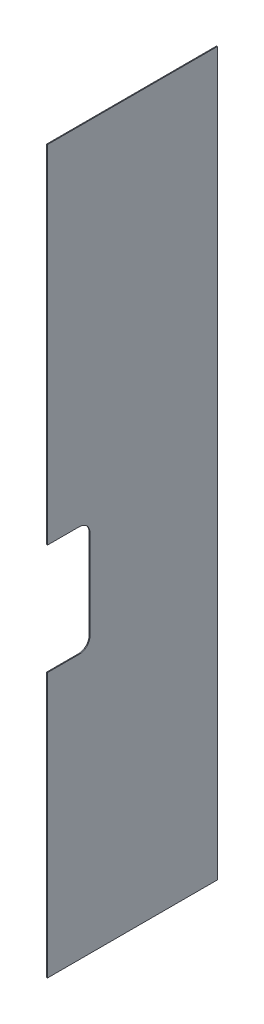
ISO-10303-21;
HEADER;
FILE_DESCRIPTION(('STEP AP214'),'2;1');
FILE_NAME('part.step','',(''),(''),'','','');
FILE_SCHEMA(('AUTOMOTIVE_DESIGN { 1 0 10303 214 1 1 1 1 }'));
ENDSEC;
DATA;
#1=APPLICATION_CONTEXT('core data for automotive mechanical design processes');
#2=APPLICATION_PROTOCOL_DEFINITION('international standard','automotive_design',2000,#1);
#3=PRODUCT_CONTEXT('',#1,'mechanical');
#4=PRODUCT('Part','Part','',(#3));
#5=PRODUCT_RELATED_PRODUCT_CATEGORY('part','',(#4));
#6=PRODUCT_DEFINITION_FORMATION('','',#4);
#7=PRODUCT_DEFINITION_CONTEXT('part definition',#1,'design');
#8=PRODUCT_DEFINITION('design','',#6,#7);
#9=PRODUCT_DEFINITION_SHAPE('','',#8);
#10=(LENGTH_UNIT() NAMED_UNIT(*) SI_UNIT(.MILLI.,.METRE.));
#11=(NAMED_UNIT(*) PLANE_ANGLE_UNIT() SI_UNIT($,.RADIAN.));
#12=(NAMED_UNIT(*) SI_UNIT($,.STERADIAN.) SOLID_ANGLE_UNIT());
#13=UNCERTAINTY_MEASURE_WITH_UNIT(LENGTH_MEASURE(1.E-05),#10,'distance_accuracy_value','');
#14=(GEOMETRIC_REPRESENTATION_CONTEXT(3) GLOBAL_UNCERTAINTY_ASSIGNED_CONTEXT((#13)) GLOBAL_UNIT_ASSIGNED_CONTEXT((#10,
#11,#12)) REPRESENTATION_CONTEXT('',''));
#15=CARTESIAN_POINT('',(0.,0.,0.));
#16=DIRECTION('',(0.,0.,1.));
#17=DIRECTION('',(1.,0.,0.));
#18=AXIS2_PLACEMENT_3D('',#15,#16,#17);
#19=CARTESIAN_POINT('',(0.254,0.,-171.45));
#20=DIRECTION('',(0.,0.,-1.));
#21=DIRECTION('',(0.,1.,0.));
#22=AXIS2_PLACEMENT_3D('',#19,#20,#21);
#23=PLANE('',#22);
#24=DIRECTION('',(0.,-1.,0.));
#25=VECTOR('',#24,1.);
#26=CARTESIAN_POINT('',(0.254,0.,-171.45));
#27=LINE('',#26,#25);
#28=CARTESIAN_POINT('',(0.254,-136.779,-171.45));
#29=VERTEX_POINT('',#28);
#30=CARTESIAN_POINT('',(0.254,-215.9,-171.45));
#31=VERTEX_POINT('',#30);
#32=EDGE_CURVE('E92',#29,#31,#27,.T.);
#33=ORIENTED_EDGE('',*,*,#32,.F.);
#34=DIRECTION('',(-1.,0.,0.));
#35=VECTOR('',#34,1.);
#36=CARTESIAN_POINT('',(0.254,-136.779,-171.45));
#37=LINE('',#36,#35);
#38=CARTESIAN_POINT('',(0.,-136.779,-171.45));
#39=VERTEX_POINT('',#38);
#40=EDGE_CURVE('E116',#29,#39,#37,.T.);
#41=ORIENTED_EDGE('',*,*,#40,.T.);
#42=DIRECTION('',(0.,-1.,0.));
#43=VECTOR('',#42,1.);
#44=CARTESIAN_POINT('',(0.,0.,-171.45));
#45=LINE('',#44,#43);
#46=CARTESIAN_POINT('',(0.,-215.9,-171.45));
#47=VERTEX_POINT('',#46);
#48=EDGE_CURVE('E88',#39,#47,#45,.T.);
#49=ORIENTED_EDGE('',*,*,#48,.T.);
#50=DIRECTION('',(-1.,0.,0.));
#51=VECTOR('',#50,1.);
#52=CARTESIAN_POINT('',(0.254,-215.9,-171.45));
#53=LINE('',#52,#51);
#54=EDGE_CURVE('E11',#31,#47,#53,.T.);
#55=ORIENTED_EDGE('',*,*,#54,.F.);
#56=EDGE_LOOP('',(#33,#41,#49,#55));
#57=FACE_BOUND('',#56,.T.);
#58=ADVANCED_FACE('F35',(#57),#23,.F.);
#59=CARTESIAN_POINT('',(0.,0.,-171.45));
#60=VERTEX_POINT('',#59);
#61=CARTESIAN_POINT('',(0.,-103.759,-171.45));
#62=VERTEX_POINT('',#61);
#63=EDGE_CURVE('E74',#60,#62,#45,.T.);
#64=ORIENTED_EDGE('',*,*,#63,.T.);
#65=DIRECTION('',(-1.,0.,0.));
#66=VECTOR('',#65,1.);
#67=CARTESIAN_POINT('',(0.254,-103.759,-171.45));
#68=LINE('',#67,#66);
#69=CARTESIAN_POINT('',(0.254,-103.759,-171.45));
#70=VERTEX_POINT('',#69);
#71=EDGE_CURVE('E50',#70,#62,#68,.T.);
#72=ORIENTED_EDGE('',*,*,#71,.F.);
#73=CARTESIAN_POINT('',(0.254,0.,-171.45));
#74=VERTEX_POINT('',#73);
#75=EDGE_CURVE('E76',#74,#70,#27,.T.);
#76=ORIENTED_EDGE('',*,*,#75,.F.);
#77=DIRECTION('',(-1.,0.,0.));
#78=VECTOR('',#77,1.);
#79=CARTESIAN_POINT('',(0.254,0.,-171.45));
#80=LINE('',#79,#78);
#81=EDGE_CURVE('E59',#74,#60,#80,.T.);
#82=ORIENTED_EDGE('',*,*,#81,.T.);
#83=EDGE_LOOP('',(#64,#72,#76,#82));
#84=FACE_BOUND('',#83,.T.);
#85=ADVANCED_FACE('F37',(#84),#23,.F.);
#86=CARTESIAN_POINT('',(0.254,0.,-222.25));
#87=DIRECTION('',(0.,0.,-1.));
#88=DIRECTION('',(0.,1.,0.));
#89=AXIS2_PLACEMENT_3D('',#86,#87,#88);
#90=PLANE('',#89);
#91=DIRECTION('',(-1.,0.,0.));
#92=VECTOR('',#91,1.);
#93=CARTESIAN_POINT('',(0.254,-215.9,-222.25));
#94=LINE('',#93,#92);
#95=CARTESIAN_POINT('',(0.254,-215.9,-222.25));
#96=VERTEX_POINT('',#95);
#97=CARTESIAN_POINT('',(0.,-215.9,-222.25));
#98=VERTEX_POINT('',#97);
#99=EDGE_CURVE('E133',#96,#98,#94,.T.);
#100=ORIENTED_EDGE('',*,*,#99,.T.);
#101=DIRECTION('',(0.,-1.,0.));
#102=VECTOR('',#101,1.);
#103=CARTESIAN_POINT('',(0.,0.,-222.25));
#104=LINE('',#103,#102);
#105=CARTESIAN_POINT('',(0.,0.,-222.25));
#106=VERTEX_POINT('',#105);
#107=EDGE_CURVE('E87',#106,#98,#104,.T.);
#108=ORIENTED_EDGE('',*,*,#107,.F.);
#109=DIRECTION('',(-1.,0.,0.));
#110=VECTOR('',#109,1.);
#111=CARTESIAN_POINT('',(0.254,0.,-222.25));
#112=LINE('',#111,#110);
#113=CARTESIAN_POINT('',(0.254,0.,-222.25));
#114=VERTEX_POINT('',#113);
#115=EDGE_CURVE('E43',#114,#106,#112,.T.);
#116=ORIENTED_EDGE('',*,*,#115,.F.);
#117=DIRECTION('',(0.,-1.,0.));
#118=VECTOR('',#117,1.);
#119=CARTESIAN_POINT('',(0.254,0.,-222.25));
#120=LINE('',#119,#118);
#121=EDGE_CURVE('E99',#114,#96,#120,.T.);
#122=ORIENTED_EDGE('',*,*,#121,.T.);
#123=EDGE_LOOP('',(#100,#108,#116,#122));
#124=FACE_BOUND('',#123,.T.);
#125=ADVANCED_FACE('F167',(#124),#90,.T.);
#126=CARTESIAN_POINT('',(0.254,0.,0.));
#127=DIRECTION('',(0.,1.,0.));
#128=DIRECTION('',(0.,0.,1.));
#129=AXIS2_PLACEMENT_3D('',#126,#127,#128);
#130=PLANE('',#129);
#131=DIRECTION('',(0.,0.,-1.));
#132=VECTOR('',#131,1.);
#133=CARTESIAN_POINT('',(0.,0.,0.));
#134=LINE('',#133,#132);
#135=EDGE_CURVE('E84',#60,#106,#134,.T.);
#136=ORIENTED_EDGE('',*,*,#135,.F.);
#137=ORIENTED_EDGE('',*,*,#81,.F.);
#138=DIRECTION('',(0.,0.,-1.));
#139=VECTOR('',#138,1.);
#140=CARTESIAN_POINT('',(0.254,0.,0.));
#141=LINE('',#140,#139);
#142=EDGE_CURVE('E78',#74,#114,#141,.T.);
#143=ORIENTED_EDGE('',*,*,#142,.T.);
#144=ORIENTED_EDGE('',*,*,#115,.T.);
#145=EDGE_LOOP('',(#136,#137,#143,#144));
#146=FACE_BOUND('',#145,.T.);
#147=ADVANCED_FACE('F90',(#146),#130,.T.);
#148=CARTESIAN_POINT('',(0.254,0.,0.));
#149=DIRECTION('',(1.,0.,0.));
#150=DIRECTION('',(0.,0.,-1.));
#151=AXIS2_PLACEMENT_3D('',#148,#149,#150);
#152=PLANE('',#151);
#153=DIRECTION('',(0.,0.,-1.));
#154=VECTOR('',#153,1.);
#155=CARTESIAN_POINT('',(0.254,-215.9,0.));
#156=LINE('',#155,#154);
#157=EDGE_CURVE('E149',#31,#96,#156,.T.);
#158=ORIENTED_EDGE('',*,*,#157,.T.);
#159=ORIENTED_EDGE('',*,*,#121,.F.);
#160=ORIENTED_EDGE('',*,*,#142,.F.);
#161=ORIENTED_EDGE('',*,*,#75,.T.);
#162=DIRECTION('',(0.,0.,-1.));
#163=VECTOR('',#162,1.);
#164=CARTESIAN_POINT('',(0.254,-103.759,-171.45));
#165=LINE('',#164,#163);
#166=CARTESIAN_POINT('',(0.254,-103.759,-180.975));
#167=VERTEX_POINT('',#166);
#168=EDGE_CURVE('E122',#70,#167,#165,.T.);
#169=ORIENTED_EDGE('',*,*,#168,.T.);
#170=CARTESIAN_POINT('',(0.254,-106.934,-180.975));
#171=DIRECTION('',(-1.,0.,0.));
#172=DIRECTION('',(0.,0.,-1.));
#173=AXIS2_PLACEMENT_3D('',#170,#171,#172);
#174=CIRCLE('',#173,3.175);
#175=CARTESIAN_POINT('',(0.254,-106.934,-184.15));
#176=VERTEX_POINT('',#175);
#177=EDGE_CURVE('E142',#167,#176,#174,.T.);
#178=ORIENTED_EDGE('',*,*,#177,.T.);
#179=DIRECTION('',(0.,-1.,0.));
#180=VECTOR('',#179,1.);
#181=CARTESIAN_POINT('',(0.254,-106.934,-184.15));
#182=LINE('',#181,#180);
#183=CARTESIAN_POINT('',(0.254,-133.604,-184.15));
#184=VERTEX_POINT('',#183);
#185=EDGE_CURVE('E139',#176,#184,#182,.T.);
#186=ORIENTED_EDGE('',*,*,#185,.T.);
#187=CARTESIAN_POINT('',(0.254,-133.604,-180.975));
#188=DIRECTION('',(-1.,0.,0.));
#189=DIRECTION('',(0.,0.,-1.));
#190=AXIS2_PLACEMENT_3D('',#187,#188,#189);
#191=CIRCLE('',#190,3.175);
#192=CARTESIAN_POINT('',(0.254,-136.779,-180.975));
#193=VERTEX_POINT('',#192);
#194=EDGE_CURVE('E136',#184,#193,#191,.T.);
#195=ORIENTED_EDGE('',*,*,#194,.T.);
#196=DIRECTION('',(0.,0.,1.));
#197=VECTOR('',#196,1.);
#198=CARTESIAN_POINT('',(0.254,-136.779,-171.45));
#199=LINE('',#198,#197);
#200=EDGE_CURVE('E104',#193,#29,#199,.T.);
#201=ORIENTED_EDGE('',*,*,#200,.T.);
#202=ORIENTED_EDGE('',*,*,#32,.T.);
#203=EDGE_LOOP('',(#158,#159,#160,#161,#169,#178,#186,#195,#201,#202));
#204=FACE_BOUND('',#203,.T.);
#205=ADVANCED_FACE('F158',(#204),#152,.T.);
#206=CARTESIAN_POINT('',(0.,0.,0.));
#207=DIRECTION('',(1.,0.,0.));
#208=DIRECTION('',(0.,0.,-1.));
#209=AXIS2_PLACEMENT_3D('',#206,#207,#208);
#210=PLANE('',#209);
#211=ORIENTED_EDGE('',*,*,#107,.T.);
#212=DIRECTION('',(0.,0.,-1.));
#213=VECTOR('',#212,1.);
#214=CARTESIAN_POINT('',(0.,-215.9,0.));
#215=LINE('',#214,#213);
#216=EDGE_CURVE('E150',#47,#98,#215,.T.);
#217=ORIENTED_EDGE('',*,*,#216,.F.);
#218=ORIENTED_EDGE('',*,*,#48,.F.);
#219=DIRECTION('',(0.,0.,1.));
#220=VECTOR('',#219,1.);
#221=CARTESIAN_POINT('',(0.,-136.779,-171.45));
#222=LINE('',#221,#220);
#223=CARTESIAN_POINT('',(0.,-136.779,-180.975));
#224=VERTEX_POINT('',#223);
#225=EDGE_CURVE('E119',#224,#39,#222,.T.);
#226=ORIENTED_EDGE('',*,*,#225,.F.);
#227=CARTESIAN_POINT('',(0.,-133.604,-180.975));
#228=DIRECTION('',(-1.,0.,0.));
#229=DIRECTION('',(0.,0.,-1.));
#230=AXIS2_PLACEMENT_3D('',#227,#228,#229);
#231=CIRCLE('',#230,3.175);
#232=CARTESIAN_POINT('',(0.,-133.604,-184.15));
#233=VERTEX_POINT('',#232);
#234=EDGE_CURVE('E123',#233,#224,#231,.T.);
#235=ORIENTED_EDGE('',*,*,#234,.F.);
#236=DIRECTION('',(0.,-1.,0.));
#237=VECTOR('',#236,1.);
#238=CARTESIAN_POINT('',(0.,-106.934,-184.15));
#239=LINE('',#238,#237);
#240=CARTESIAN_POINT('',(0.,-106.934,-184.15));
#241=VERTEX_POINT('',#240);
#242=EDGE_CURVE('E126',#241,#233,#239,.T.);
#243=ORIENTED_EDGE('',*,*,#242,.F.);
#244=CARTESIAN_POINT('',(0.,-106.934,-180.975));
#245=DIRECTION('',(-1.,0.,0.));
#246=DIRECTION('',(0.,0.,-1.));
#247=AXIS2_PLACEMENT_3D('',#244,#245,#246);
#248=CIRCLE('',#247,3.175);
#249=CARTESIAN_POINT('',(0.,-103.759,-180.975));
#250=VERTEX_POINT('',#249);
#251=EDGE_CURVE('E129',#250,#241,#248,.T.);
#252=ORIENTED_EDGE('',*,*,#251,.F.);
#253=DIRECTION('',(0.,0.,-1.));
#254=VECTOR('',#253,1.);
#255=CARTESIAN_POINT('',(0.,-103.759,-171.45));
#256=LINE('',#255,#254);
#257=EDGE_CURVE('E86',#62,#250,#256,.T.);
#258=ORIENTED_EDGE('',*,*,#257,.F.);
#259=ORIENTED_EDGE('',*,*,#63,.F.);
#260=ORIENTED_EDGE('',*,*,#135,.T.);
#261=EDGE_LOOP('',(#211,#217,#218,#226,#235,#243,#252,#258,#259,#260));
#262=FACE_BOUND('',#261,.T.);
#263=ADVANCED_FACE('F83',(#262),#210,.F.);
#264=CARTESIAN_POINT('',(0.254,-136.779,-171.45));
#265=DIRECTION('',(0.,-1.,0.));
#266=DIRECTION('',(0.,0.,-1.));
#267=AXIS2_PLACEMENT_3D('',#264,#265,#266);
#268=PLANE('',#267);
#269=ORIENTED_EDGE('',*,*,#225,.T.);
#270=ORIENTED_EDGE('',*,*,#40,.F.);
#271=ORIENTED_EDGE('',*,*,#200,.F.);
#272=DIRECTION('',(-1.,0.,0.));
#273=VECTOR('',#272,1.);
#274=CARTESIAN_POINT('',(0.254,-136.779,-180.975));
#275=LINE('',#274,#273);
#276=EDGE_CURVE('E113',#193,#224,#275,.T.);
#277=ORIENTED_EDGE('',*,*,#276,.T.);
#278=EDGE_LOOP('',(#269,#270,#271,#277));
#279=FACE_BOUND('',#278,.T.);
#280=ADVANCED_FACE('F200',(#279),#268,.F.);
#281=CARTESIAN_POINT('',(0.254,-133.604,-180.975));
#282=DIRECTION('',(-1.,0.,0.));
#283=DIRECTION('',(0.,0.,1.));
#284=AXIS2_PLACEMENT_3D('',#281,#282,#283);
#285=CYLINDRICAL_SURFACE('',#284,3.175);
#286=ORIENTED_EDGE('',*,*,#234,.T.);
#287=ORIENTED_EDGE('',*,*,#276,.F.);
#288=ORIENTED_EDGE('',*,*,#194,.F.);
#289=DIRECTION('',(-1.,0.,0.));
#290=VECTOR('',#289,1.);
#291=CARTESIAN_POINT('',(0.254,-133.604,-184.15));
#292=LINE('',#291,#290);
#293=EDGE_CURVE('E110',#184,#233,#292,.T.);
#294=ORIENTED_EDGE('',*,*,#293,.T.);
#295=EDGE_LOOP('',(#286,#287,#288,#294));
#296=FACE_BOUND('',#295,.T.);
#297=ADVANCED_FACE('F236',(#296),#285,.F.);
#298=CARTESIAN_POINT('',(0.254,-106.934,-184.15));
#299=DIRECTION('',(0.,0.,-1.));
#300=DIRECTION('',(-1.,0.,0.));
#301=AXIS2_PLACEMENT_3D('',#298,#299,#300);
#302=PLANE('',#301);
#303=ORIENTED_EDGE('',*,*,#242,.T.);
#304=ORIENTED_EDGE('',*,*,#293,.F.);
#305=ORIENTED_EDGE('',*,*,#185,.F.);
#306=DIRECTION('',(-1.,0.,0.));
#307=VECTOR('',#306,1.);
#308=CARTESIAN_POINT('',(0.254,-106.934,-184.15));
#309=LINE('',#308,#307);
#310=EDGE_CURVE('E107',#176,#241,#309,.T.);
#311=ORIENTED_EDGE('',*,*,#310,.T.);
#312=EDGE_LOOP('',(#303,#304,#305,#311));
#313=FACE_BOUND('',#312,.T.);
#314=ADVANCED_FACE('F232',(#313),#302,.F.);
#315=CARTESIAN_POINT('',(0.254,-106.934,-180.975));
#316=DIRECTION('',(-1.,0.,0.));
#317=DIRECTION('',(0.,0.,1.));
#318=AXIS2_PLACEMENT_3D('',#315,#316,#317);
#319=CYLINDRICAL_SURFACE('',#318,3.175);
#320=ORIENTED_EDGE('',*,*,#251,.T.);
#321=ORIENTED_EDGE('',*,*,#310,.F.);
#322=ORIENTED_EDGE('',*,*,#177,.F.);
#323=DIRECTION('',(-1.,0.,0.));
#324=VECTOR('',#323,1.);
#325=CARTESIAN_POINT('',(0.254,-103.759,-180.975));
#326=LINE('',#325,#324);
#327=EDGE_CURVE('E103',#167,#250,#326,.T.);
#328=ORIENTED_EDGE('',*,*,#327,.T.);
#329=EDGE_LOOP('',(#320,#321,#322,#328));
#330=FACE_BOUND('',#329,.T.);
#331=ADVANCED_FACE('F211',(#330),#319,.F.);
#332=CARTESIAN_POINT('',(0.254,-103.759,-171.45));
#333=DIRECTION('',(0.,1.,0.));
#334=DIRECTION('',(0.,0.,1.));
#335=AXIS2_PLACEMENT_3D('',#332,#333,#334);
#336=PLANE('',#335);
#337=ORIENTED_EDGE('',*,*,#257,.T.);
#338=ORIENTED_EDGE('',*,*,#327,.F.);
#339=ORIENTED_EDGE('',*,*,#168,.F.);
#340=ORIENTED_EDGE('',*,*,#71,.T.);
#341=EDGE_LOOP('',(#337,#338,#339,#340));
#342=FACE_BOUND('',#341,.T.);
#343=ADVANCED_FACE('F206',(#342),#336,.F.);
#344=CARTESIAN_POINT('',(0.254,-215.9,0.));
#345=DIRECTION('',(0.,1.,0.));
#346=DIRECTION('',(0.,0.,1.));
#347=AXIS2_PLACEMENT_3D('',#344,#345,#346);
#348=PLANE('',#347);
#349=ORIENTED_EDGE('',*,*,#216,.T.);
#350=ORIENTED_EDGE('',*,*,#99,.F.);
#351=ORIENTED_EDGE('',*,*,#157,.F.);
#352=ORIENTED_EDGE('',*,*,#54,.T.);
#353=EDGE_LOOP('',(#349,#350,#351,#352));
#354=FACE_BOUND('',#353,.T.);
#355=ADVANCED_FACE('F204',(#354),#348,.F.);
#356=CLOSED_SHELL('',(#58,#85,#125,#147,#205,#263,#280,#297,#314,#331,#343,#355));
#357=MANIFOLD_SOLID_BREP('B2',#356);
#358=ADVANCED_BREP_SHAPE_REPRESENTATION('',(#18,#357),#14);
#359=SHAPE_DEFINITION_REPRESENTATION(#9,#358);
ENDSEC;
END-ISO-10303-21;
